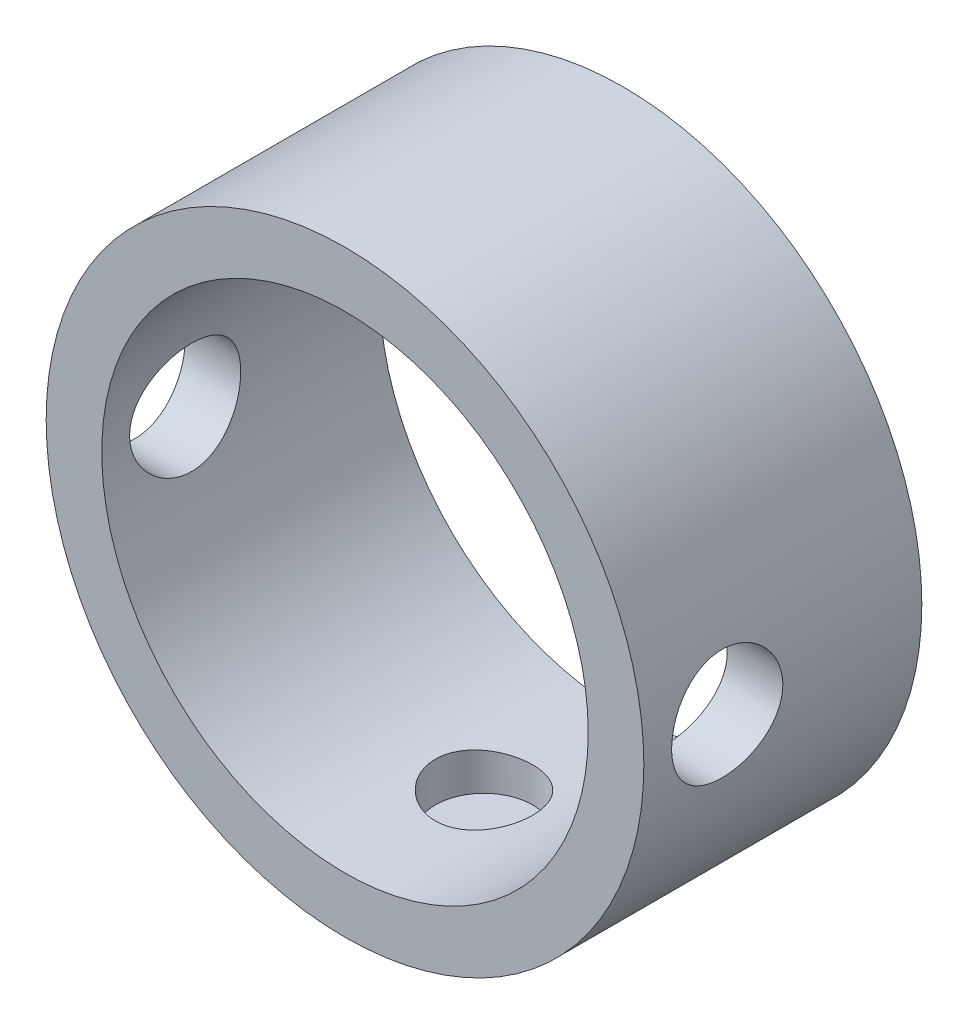
ISO-10303-21;
HEADER;
FILE_DESCRIPTION(('STEP AP214'),'2;1');
FILE_NAME('part.step','',(''),(''),'','','');
FILE_SCHEMA(('AUTOMOTIVE_DESIGN { 1 0 10303 214 1 1 1 1 }'));
ENDSEC;
DATA;
#1=APPLICATION_CONTEXT('core data for automotive mechanical design processes');
#2=APPLICATION_PROTOCOL_DEFINITION('international standard','automotive_design',2000,#1);
#3=PRODUCT_CONTEXT('',#1,'mechanical');
#4=PRODUCT('Part','Part','',(#3));
#5=PRODUCT_RELATED_PRODUCT_CATEGORY('part','',(#4));
#6=PRODUCT_DEFINITION_FORMATION('','',#4);
#7=PRODUCT_DEFINITION_CONTEXT('part definition',#1,'design');
#8=PRODUCT_DEFINITION('design','',#6,#7);
#9=PRODUCT_DEFINITION_SHAPE('','',#8);
#10=(LENGTH_UNIT() NAMED_UNIT(*) SI_UNIT(.MILLI.,.METRE.));
#11=(NAMED_UNIT(*) PLANE_ANGLE_UNIT() SI_UNIT($,.RADIAN.));
#12=(NAMED_UNIT(*) SI_UNIT($,.STERADIAN.) SOLID_ANGLE_UNIT());
#13=UNCERTAINTY_MEASURE_WITH_UNIT(LENGTH_MEASURE(1.E-05),#10,'distance_accuracy_value','');
#14=(GEOMETRIC_REPRESENTATION_CONTEXT(3) GLOBAL_UNCERTAINTY_ASSIGNED_CONTEXT((#13)) GLOBAL_UNIT_ASSIGNED_CONTEXT((#10,
#11,#12)) REPRESENTATION_CONTEXT('',''));
#15=CARTESIAN_POINT('',(0.,0.,0.));
#16=DIRECTION('',(0.,0.,1.));
#17=DIRECTION('',(1.,0.,0.));
#18=AXIS2_PLACEMENT_3D('',#15,#16,#17);
#19=CARTESIAN_POINT('',(0.,0.,10.));
#20=DIRECTION('',(0.,0.,1.));
#21=DIRECTION('',(1.,0.,0.));
#22=AXIS2_PLACEMENT_3D('',#19,#20,#21);
#23=PLANE('',#22);
#24=CARTESIAN_POINT('',(0.,0.,10.));
#25=DIRECTION('',(0.,0.,1.));
#26=DIRECTION('',(1.,0.,0.));
#27=AXIS2_PLACEMENT_3D('',#24,#25,#26);
#28=CIRCLE('',#27,10.75);
#29=CARTESIAN_POINT('',(10.75,0.,10.));
#30=VERTEX_POINT('',#29);
#31=EDGE_CURVE('E10',#30,#30,#28,.T.);
#32=ORIENTED_EDGE('',*,*,#31,.T.);
#33=EDGE_LOOP('',(#32));
#34=FACE_BOUND('',#33,.T.);
#35=CARTESIAN_POINT('',(0.,0.,10.));
#36=DIRECTION('',(0.,0.,1.));
#37=DIRECTION('',(1.,0.,0.));
#38=AXIS2_PLACEMENT_3D('',#35,#36,#37);
#39=CIRCLE('',#38,8.75);
#40=CARTESIAN_POINT('',(8.75,0.,10.));
#41=VERTEX_POINT('',#40);
#42=EDGE_CURVE('E49',#41,#41,#39,.T.);
#43=ORIENTED_EDGE('',*,*,#42,.F.);
#44=EDGE_LOOP('',(#43));
#45=FACE_BOUND('',#44,.T.);
#46=ADVANCED_FACE('F31',(#34,#45),#23,.T.);
#47=CARTESIAN_POINT('',(0.,0.,0.));
#48=DIRECTION('',(0.,0.,1.));
#49=DIRECTION('',(1.,0.,0.));
#50=AXIS2_PLACEMENT_3D('',#47,#48,#49);
#51=PLANE('',#50);
#52=CARTESIAN_POINT('',(0.,0.,0.));
#53=DIRECTION('',(0.,0.,1.));
#54=DIRECTION('',(1.,0.,0.));
#55=AXIS2_PLACEMENT_3D('',#52,#53,#54);
#56=CIRCLE('',#55,10.75);
#57=CARTESIAN_POINT('',(10.75,0.,0.));
#58=VERTEX_POINT('',#57);
#59=EDGE_CURVE('E44',#58,#58,#56,.T.);
#60=ORIENTED_EDGE('',*,*,#59,.F.);
#61=EDGE_LOOP('',(#60));
#62=FACE_BOUND('',#61,.T.);
#63=CARTESIAN_POINT('',(0.,0.,0.));
#64=DIRECTION('',(0.,0.,1.));
#65=DIRECTION('',(1.,0.,0.));
#66=AXIS2_PLACEMENT_3D('',#63,#64,#65);
#67=CIRCLE('',#66,8.75);
#68=CARTESIAN_POINT('',(8.75,0.,0.));
#69=VERTEX_POINT('',#68);
#70=EDGE_CURVE('E52',#69,#69,#67,.T.);
#71=ORIENTED_EDGE('',*,*,#70,.T.);
#72=EDGE_LOOP('',(#71));
#73=FACE_BOUND('',#72,.T.);
#74=ADVANCED_FACE('F101',(#62,#73),#51,.F.);
#75=CARTESIAN_POINT('',(0.,0.,10.));
#76=DIRECTION('',(0.,0.,-1.));
#77=DIRECTION('',(-1.,0.,0.));
#78=AXIS2_PLACEMENT_3D('',#75,#76,#77);
#79=CYLINDRICAL_SURFACE('',#78,10.75);
#80=CARTESIAN_POINT('',(-10.75,0.,9.));
#81=CARTESIAN_POINT('',(-10.7499979898458,-0.11131159379338,8.99999572987923));
#82=CARTESIAN_POINT('',(-10.7482532629214,-0.222678927988622,8.99067589570434));
#83=CARTESIAN_POINT('',(-10.7414613570524,-0.44227641097823,8.95366618191143));
#84=CARTESIAN_POINT('',(-10.7364113726521,-0.55050381307307,8.92596069653518));
#85=CARTESIAN_POINT('',(-10.7235739677097,-0.760613722877673,8.85305648014376));
#86=CARTESIAN_POINT('',(-10.7157890029718,-0.862501826502631,8.80787343897761));
#87=CARTESIAN_POINT('',(-10.6983321752382,-1.05724142795962,8.70134097973054));
#88=CARTESIAN_POINT('',(-10.6886604695776,-1.15009367832323,8.63999290949974));
#89=CARTESIAN_POINT('',(-10.6683704245625,-1.32523104603137,8.5021033437944));
#90=CARTESIAN_POINT('',(-10.6577431617574,-1.40739412690166,8.4254081434464));
#91=CARTESIAN_POINT('',(-10.6368061412874,-1.55776522630777,8.25933206935554));
#92=CARTESIAN_POINT('',(-10.626496406262,-1.62597225173912,8.16995029360961));
#93=CARTESIAN_POINT('',(-10.6072750364208,-1.74700132637669,7.98017760282761));
#94=CARTESIAN_POINT('',(-10.5983749089917,-1.79969948726446,7.87970640896275));
#95=CARTESIAN_POINT('',(-10.5831060557579,-1.88742190435403,7.67114363019245));
#96=CARTESIAN_POINT('',(-10.5767371151844,-1.92244766011071,7.56305269273174));
#97=CARTESIAN_POINT('',(-10.5673414942507,-1.973439875545,7.34362364439491));
#98=CARTESIAN_POINT('',(-10.5642775486884,-1.98961900866356,7.23233658297204));
#99=CARTESIAN_POINT('',(-10.5617264498057,-2.00311878575036,7.00858852041986));
#100=CARTESIAN_POINT('',(-10.5622389807437,-2.00044109445366,6.89612762379538));
#101=CARTESIAN_POINT('',(-10.5667489902013,-1.97647574032907,6.6747633700392));
#102=CARTESIAN_POINT('',(-10.5707012207446,-1.95542969630261,6.56583279686444));
#103=CARTESIAN_POINT('',(-10.5815742581251,-1.89570547233203,6.35307612785986));
#104=CARTESIAN_POINT('',(-10.5884951893386,-1.85702655363861,6.24925024609882));
#105=CARTESIAN_POINT('',(-10.6045732299577,-1.76289760519039,6.04894203213756));
#106=CARTESIAN_POINT('',(-10.6137433132819,-1.70734981035866,5.95250672612123));
#107=CARTESIAN_POINT('',(-10.6332778111083,-1.58112906966637,5.7702346903743));
#108=CARTESIAN_POINT('',(-10.6436423449628,-1.51045461170914,5.68439902156196));
#109=CARTESIAN_POINT('',(-10.6645952021616,-1.35468302139281,5.52436661849693));
#110=CARTESIAN_POINT('',(-10.6751845030451,-1.26937917698147,5.45037107360264));
#111=CARTESIAN_POINT('',(-10.6952459378521,-1.08746251784783,5.31771042100191));
#112=CARTESIAN_POINT('',(-10.7047180608997,-0.990849593049999,5.25904546253179));
#113=CARTESIAN_POINT('',(-10.7214965653293,-0.788848913738091,5.15868245967962));
#114=CARTESIAN_POINT('',(-10.7288003023682,-0.683450644392863,5.11700510875821));
#115=CARTESIAN_POINT('',(-10.7403986151714,-0.466983118908588,5.05200257111017));
#116=CARTESIAN_POINT('',(-10.7446935055784,-0.355914457040342,5.02867546542097));
#117=CARTESIAN_POINT('',(-10.749747054897,-0.13299011359431,5.00131508847892));
#118=CARTESIAN_POINT('',(-10.7505562406137,-0.0211693776720211,4.99700611832965));
#119=CARTESIAN_POINT('',(-10.7486866910348,0.201594891573391,5.00706512429286));
#120=CARTESIAN_POINT('',(-10.746008124353,0.312538467041593,5.02143219752003));
#121=CARTESIAN_POINT('',(-10.7374954871991,0.529526335547115,5.06820623777382));
#122=CARTESIAN_POINT('',(-10.7316857895141,0.635601691889519,5.10047392223406));
#123=CARTESIAN_POINT('',(-10.7175596292842,0.840836917634937,5.18198266408515));
#124=CARTESIAN_POINT('',(-10.7092429986024,0.93999632264453,5.2312248599665));
#125=CARTESIAN_POINT('',(-10.690899466265,1.12976302751242,5.34589657796905));
#126=CARTESIAN_POINT('',(-10.6808550983115,1.22026664017755,5.41149483797731));
#127=CARTESIAN_POINT('',(-10.6602158463005,1.38908020214383,5.55678798245869));
#128=CARTESIAN_POINT('',(-10.6496209117495,1.46738903039658,5.63648416149583));
#129=CARTESIAN_POINT('',(-10.6289073271526,1.61063585835205,5.80895817564184));
#130=CARTESIAN_POINT('',(-10.6187967061924,1.67538584359746,5.90189328874258));
#131=CARTESIAN_POINT('',(-10.6003572432835,1.78835572865782,6.09748322825249));
#132=CARTESIAN_POINT('',(-10.5920283357576,1.83657623689074,6.20013769673351));
#133=CARTESIAN_POINT('',(-10.5781581458697,1.91485072686294,6.41177151124483));
#134=CARTESIAN_POINT('',(-10.5726035790055,1.94499142330357,6.52071787390127));
#135=CARTESIAN_POINT('',(-10.5648804078248,1.98651855905319,6.74224124574429));
#136=CARTESIAN_POINT('',(-10.5627114280671,1.99790707787205,6.85481785094575));
#137=CARTESIAN_POINT('',(-10.5620238464973,2.0015378387343,7.07852322734323));
#138=CARTESIAN_POINT('',(-10.5634487096283,1.99407660485924,7.18964712056155));
#139=CARTESIAN_POINT('',(-10.5696630140558,1.96086826235294,7.40902732963684));
#140=CARTESIAN_POINT('',(-10.5744524359854,1.93512125897719,7.51728366199618));
#141=CARTESIAN_POINT('',(-10.5868325708344,1.86619652593107,7.72769952322193));
#142=CARTESIAN_POINT('',(-10.5944181984275,1.82305042586657,7.82986973122518));
#143=CARTESIAN_POINT('',(-10.6115397210939,1.72058453403723,8.02556856504766));
#144=CARTESIAN_POINT('',(-10.6210757509919,1.66126362406717,8.11909659281254));
#145=CARTESIAN_POINT('',(-10.6411993787578,1.52709910875286,8.29634244119845));
#146=CARTESIAN_POINT('',(-10.6518004083814,1.45203952456124,8.37989528142713));
#147=CARTESIAN_POINT('',(-10.6727585996435,1.28897910123111,8.53331890454813));
#148=CARTESIAN_POINT('',(-10.6831157046926,1.20097529273818,8.60318653951033));
#149=CARTESIAN_POINT('',(-10.7025264342028,1.01359257586739,8.72783285057219));
#150=CARTESIAN_POINT('',(-10.7115677213292,0.914119954343318,8.78247262327906));
#151=CARTESIAN_POINT('',(-10.7272076880381,0.707271124587948,8.87417762043734));
#152=CARTESIAN_POINT('',(-10.7338086708492,0.599902484214423,8.91125942592901));
#153=CARTESIAN_POINT('',(-10.7424715014638,0.410175384596366,8.95922830111321));
#154=CARTESIAN_POINT('',(-10.745278807836,0.328929119163652,8.97449168030223));
#155=CARTESIAN_POINT('',(-10.7490437798718,0.165132107553959,8.99487898823888));
#156=CARTESIAN_POINT('',(-10.7500014913211,0.0825813937188459,9.0000031679766));
#157=CARTESIAN_POINT('',(-10.75,0.,9.));
#158=B_SPLINE_CURVE_WITH_KNOTS('',3,(#80,#81,#82,#83,#84,#85,#86,#87,#88,#89,#90,#91,#92,#93,
#94,#95,#96,#97,#98,#99,#100,#101,#102,#103,#104,#105,#106,#107,#108,#109,#110,#111,#112,#113,
#114,#115,#116,#117,#118,#119,#120,#121,#122,#123,#124,#125,#126,#127,#128,#129,#130,#131,#132,
#133,#134,#135,#136,#137,#138,#139,#140,#141,#142,#143,#144,#145,#146,#147,#148,#149,#150,#151,
#152,#153,#154,#155,#156,#157),.UNSPECIFIED.,.T.,.F.,(4,2,2,2,2,2,2,2,2,2,2,2,2,2,2,2,2,2,2,2,2,
2,2,2,2,2,2,2,2,2,2,2,2,2,2,2,2,2,4),(0.,0.333632786805725,0.66754912427414,1.0011663934096,
1.33475585412829,1.67187050268572,2.00900913178154,2.3487720265472,2.68850608659447,
3.02436811950802,3.36020050192062,3.69168078753446,4.02317496216753,4.35662824282037,
4.6901148718247,5.02877436453897,5.36743715382766,5.70651126118907,6.04554990542494,
6.37965713991974,6.71374822274426,7.04527552096235,7.37682505923946,7.71194784376343,
8.04710141746387,8.38663285340674,8.72615179051432,9.06402902298356,9.40186878426492,
9.73442721190291,10.0669837253029,10.3989383941257,10.7309160176291,11.0677885056382,
11.4047383917492,11.7446680944371,12.0842761377135,12.3318023983814,12.5793225316019),.UNSPECIFIED.);
#159=CARTESIAN_POINT('',(-10.75,0.,9.));
#160=VERTEX_POINT('',#159);
#161=EDGE_CURVE('E89',#160,#160,#158,.T.);
#162=ORIENTED_EDGE('',*,*,#161,.T.);
#163=EDGE_LOOP('',(#162));
#164=FACE_BOUND('',#163,.T.);
#165=CARTESIAN_POINT('',(10.75,0.,5.));
#166=CARTESIAN_POINT('',(10.7499979898458,-0.11131159379338,5.00000427012077));
#167=CARTESIAN_POINT('',(10.7482532629214,-0.222678927988622,5.00932410429566));
#168=CARTESIAN_POINT('',(10.7414613570524,-0.44227641097823,5.04633381808857));
#169=CARTESIAN_POINT('',(10.7364113726521,-0.55050381307307,5.07403930346482));
#170=CARTESIAN_POINT('',(10.7235739677097,-0.760613722877673,5.14694351985624));
#171=CARTESIAN_POINT('',(10.7157890029718,-0.862501826502631,5.19212656102239));
#172=CARTESIAN_POINT('',(10.6983321752382,-1.05724142795962,5.29865902026946));
#173=CARTESIAN_POINT('',(10.6886604695776,-1.15009367832323,5.36000709050025));
#174=CARTESIAN_POINT('',(10.6683704245625,-1.32523104603137,5.4978966562056));
#175=CARTESIAN_POINT('',(10.6577431617574,-1.40739412690166,5.5745918565536));
#176=CARTESIAN_POINT('',(10.6368061412874,-1.55776522630777,5.74066793064446));
#177=CARTESIAN_POINT('',(10.626496406262,-1.62597225173912,5.83004970639039));
#178=CARTESIAN_POINT('',(10.6072750364208,-1.74700132637669,6.01982239717239));
#179=CARTESIAN_POINT('',(10.5983749089917,-1.79969948726446,6.12029359103725));
#180=CARTESIAN_POINT('',(10.5831060557579,-1.88742190435403,6.32885636980755));
#181=CARTESIAN_POINT('',(10.5767371151844,-1.92244766011071,6.43694730726826));
#182=CARTESIAN_POINT('',(10.5673414942507,-1.973439875545,6.65637635560509));
#183=CARTESIAN_POINT('',(10.5642775486884,-1.98961900866356,6.76766341702796));
#184=CARTESIAN_POINT('',(10.5617264498057,-2.00311878575036,6.99141147958014));
#185=CARTESIAN_POINT('',(10.5622389807437,-2.00044109445366,7.10387237620462));
#186=CARTESIAN_POINT('',(10.5667489902013,-1.97647574032907,7.3252366299608));
#187=CARTESIAN_POINT('',(10.5707012207446,-1.95542969630261,7.43416720313556));
#188=CARTESIAN_POINT('',(10.5815742581251,-1.89570547233203,7.64692387214014));
#189=CARTESIAN_POINT('',(10.5884951893386,-1.85702655363861,7.75074975390118));
#190=CARTESIAN_POINT('',(10.6045732299577,-1.76289760519039,7.95105796786244));
#191=CARTESIAN_POINT('',(10.6137433132819,-1.70734981035866,8.04749327387877));
#192=CARTESIAN_POINT('',(10.6332778111083,-1.58112906966637,8.2297653096257));
#193=CARTESIAN_POINT('',(10.6436423449628,-1.51045461170914,8.31560097843804));
#194=CARTESIAN_POINT('',(10.6645952021616,-1.35468302139281,8.47563338150307));
#195=CARTESIAN_POINT('',(10.6751845030451,-1.26937917698147,8.54962892639736));
#196=CARTESIAN_POINT('',(10.6952459378521,-1.08746251784783,8.68228957899809));
#197=CARTESIAN_POINT('',(10.7047180608997,-0.990849593049999,8.74095453746821));
#198=CARTESIAN_POINT('',(10.7214965653293,-0.788848913738091,8.84131754032038));
#199=CARTESIAN_POINT('',(10.7288003023682,-0.683450644392863,8.88299489124179));
#200=CARTESIAN_POINT('',(10.7403986151714,-0.466983118908589,8.94799742888983));
#201=CARTESIAN_POINT('',(10.7446935055784,-0.355914457040342,8.97132453457903));
#202=CARTESIAN_POINT('',(10.749747054897,-0.13299011359431,8.99868491152108));
#203=CARTESIAN_POINT('',(10.7505562406137,-0.021169377672021,9.00299388167035));
#204=CARTESIAN_POINT('',(10.7486866910348,0.201594891573391,8.99293487570714));
#205=CARTESIAN_POINT('',(10.746008124353,0.312538467041593,8.97856780247997));
#206=CARTESIAN_POINT('',(10.7374954871991,0.529526335547115,8.93179376222618));
#207=CARTESIAN_POINT('',(10.7316857895141,0.63560169188952,8.89952607776595));
#208=CARTESIAN_POINT('',(10.7175596292842,0.840836917634938,8.81801733591485));
#209=CARTESIAN_POINT('',(10.7092429986024,0.939996322644531,8.7687751400335));
#210=CARTESIAN_POINT('',(10.690899466265,1.12976302751242,8.65410342203095));
#211=CARTESIAN_POINT('',(10.6808550983115,1.22026664017754,8.58850516202269));
#212=CARTESIAN_POINT('',(10.6602158463005,1.38908020214383,8.44321201754131));
#213=CARTESIAN_POINT('',(10.6496209117495,1.46738903039658,8.36351583850417));
#214=CARTESIAN_POINT('',(10.6289073271526,1.61063585835205,8.19104182435816));
#215=CARTESIAN_POINT('',(10.6187967061924,1.67538584359746,8.09810671125742));
#216=CARTESIAN_POINT('',(10.6003572432835,1.78835572865782,7.90251677174751));
#217=CARTESIAN_POINT('',(10.5920283357576,1.83657623689074,7.79986230326649));
#218=CARTESIAN_POINT('',(10.5781581458697,1.91485072686294,7.58822848875517));
#219=CARTESIAN_POINT('',(10.5726035790055,1.94499142330357,7.47928212609873));
#220=CARTESIAN_POINT('',(10.5648804078248,1.98651855905319,7.25775875425571));
#221=CARTESIAN_POINT('',(10.5627114280671,1.99790707787205,7.14518214905425));
#222=CARTESIAN_POINT('',(10.5620238464973,2.0015378387343,6.92147677265677));
#223=CARTESIAN_POINT('',(10.5634487096283,1.99407660485924,6.81035287943845));
#224=CARTESIAN_POINT('',(10.5696630140558,1.96086826235294,6.59097267036316));
#225=CARTESIAN_POINT('',(10.5744524359854,1.93512125897719,6.48271633800382));
#226=CARTESIAN_POINT('',(10.5868325708344,1.86619652593107,6.27230047677807));
#227=CARTESIAN_POINT('',(10.5944181984275,1.82305042586657,6.17013026877482));
#228=CARTESIAN_POINT('',(10.6115397210939,1.72058453403723,5.97443143495234));
#229=CARTESIAN_POINT('',(10.6210757509919,1.66126362406717,5.88090340718746));
#230=CARTESIAN_POINT('',(10.6411993787578,1.52709910875286,5.70365755880155));
#231=CARTESIAN_POINT('',(10.6518004083814,1.45203952456124,5.62010471857287));
#232=CARTESIAN_POINT('',(10.6727585996435,1.28897910123111,5.46668109545187));
#233=CARTESIAN_POINT('',(10.6831157046926,1.20097529273818,5.39681346048967));
#234=CARTESIAN_POINT('',(10.7025264342028,1.01359257586739,5.27216714942781));
#235=CARTESIAN_POINT('',(10.7115677213292,0.914119954343319,5.21752737672094));
#236=CARTESIAN_POINT('',(10.7272076880381,0.707271124587948,5.12582237956266));
#237=CARTESIAN_POINT('',(10.7338086708492,0.599902484214423,5.08874057407099));
#238=CARTESIAN_POINT('',(10.7424715014638,0.410175384596365,5.04077169888679));
#239=CARTESIAN_POINT('',(10.745278807836,0.328929119163651,5.02550831969777));
#240=CARTESIAN_POINT('',(10.7490437798718,0.165132107553958,5.00512101176112));
#241=CARTESIAN_POINT('',(10.7500014913211,0.0825813937188454,4.9999968320234));
#242=CARTESIAN_POINT('',(10.75,0.,5.));
#243=B_SPLINE_CURVE_WITH_KNOTS('',3,(#165,#166,#167,#168,#169,#170,#171,#172,#173,#174,#175,
#176,#177,#178,#179,#180,#181,#182,#183,#184,#185,#186,#187,#188,#189,#190,#191,#192,#193,#194,
#195,#196,#197,#198,#199,#200,#201,#202,#203,#204,#205,#206,#207,#208,#209,#210,#211,#212,#213,
#214,#215,#216,#217,#218,#219,#220,#221,#222,#223,#224,#225,#226,#227,#228,#229,#230,#231,#232,
#233,#234,#235,#236,#237,#238,#239,#240,#241,#242),.UNSPECIFIED.,.T.,.F.,(4,2,2,2,2,2,2,2,2,2,2,
2,2,2,2,2,2,2,2,2,2,2,2,2,2,2,2,2,2,2,2,2,2,2,2,2,2,2,4),(0.,0.333632786805725,0.66754912427414,
1.0011663934096,1.33475585412829,1.67187050268572,2.00900913178154,2.3487720265472,
2.68850608659447,3.02436811950802,3.36020050192062,3.69168078753446,4.02317496216753,
4.35662824282037,4.6901148718247,5.02877436453897,5.36743715382766,5.70651126118907,
6.04554990542494,6.37965713991974,6.71374822274426,7.04527552096235,7.37682505923946,
7.71194784376343,8.04710141746387,8.38663285340674,8.72615179051432,9.06402902298357,
9.40186878426492,9.73442721190291,10.0669837253029,10.3989383941257,10.7309160176291,
11.0677885056382,11.4047383917491,11.7446680944371,12.0842761377135,12.3318023983814,
12.5793225316019),.UNSPECIFIED.);
#244=CARTESIAN_POINT('',(10.75,0.,5.));
#245=VERTEX_POINT('',#244);
#246=EDGE_CURVE('E85',#245,#245,#243,.T.);
#247=ORIENTED_EDGE('',*,*,#246,.T.);
#248=EDGE_LOOP('',(#247));
#249=FACE_BOUND('',#248,.T.);
#250=ORIENTED_EDGE('',*,*,#31,.F.);
#251=EDGE_LOOP('',(#250));
#252=FACE_BOUND('',#251,.T.);
#253=ORIENTED_EDGE('',*,*,#59,.T.);
#254=EDGE_LOOP('',(#253));
#255=FACE_BOUND('',#254,.T.);
#256=ADVANCED_FACE('F33',(#164,#249,#252,#255),#79,.T.);
#257=CARTESIAN_POINT('',(0.,0.,10.));
#258=DIRECTION('',(0.,0.,-1.));
#259=DIRECTION('',(-1.,0.,0.));
#260=AXIS2_PLACEMENT_3D('',#257,#258,#259);
#261=CYLINDRICAL_SURFACE('',#260,8.75);
#262=CARTESIAN_POINT('',(-8.75,0.,9.));
#263=CARTESIAN_POINT('',(-8.74999798403401,-0.110797467641392,8.99999640079627));
#264=CARTESIAN_POINT('',(-8.74787426792563,-0.221637378479564,8.99076188264202));
#265=CARTESIAN_POINT('',(-8.73960765256352,-0.440160260645337,8.95411123361261));
#266=CARTESIAN_POINT('',(-8.73346206074067,-0.547841066516225,8.92668292217251));
#267=CARTESIAN_POINT('',(-8.71783483861599,-0.756856803303784,8.85455543125254));
#268=CARTESIAN_POINT('',(-8.70835685325835,-0.858198525771152,8.80987511664681));
#269=CARTESIAN_POINT('',(-8.68708367861657,-1.05194510817363,8.70457381564098));
#270=CARTESIAN_POINT('',(-8.6752885067451,-1.14435003525719,8.64395294902623));
#271=CARTESIAN_POINT('',(-8.65043976491944,-1.31921284380598,8.50737389507973));
#272=CARTESIAN_POINT('',(-8.63736940910119,-1.40149269853396,8.43119081567529));
#273=CARTESIAN_POINT('',(-8.61155960188236,-1.55222495575719,8.26613230531634));
#274=CARTESIAN_POINT('',(-8.59882018230991,-1.62067603251486,8.17725565884752));
#275=CARTESIAN_POINT('',(-8.5749480986638,-1.7426086602488,7.98799671893209));
#276=CARTESIAN_POINT('',(-8.56383688728399,-1.7958977927077,7.88748750837005));
#277=CARTESIAN_POINT('',(-8.54472144233678,-1.88475865669925,7.67864406419753));
#278=CARTESIAN_POINT('',(-8.53671680029431,-1.92033271771674,7.57031086156757));
#279=CARTESIAN_POINT('',(-8.52489227385479,-1.97215951306484,7.35083404907676));
#280=CARTESIAN_POINT('',(-8.52100387809606,-1.98872896544198,7.23976900047027));
#281=CARTESIAN_POINT('',(-8.51764655638893,-2.00306153817964,7.01637271053663));
#282=CARTESIAN_POINT('',(-8.51817703514422,-2.00082719172597,6.90404164179968));
#283=CARTESIAN_POINT('',(-8.52353562985453,-1.97786980705357,6.68367804056806));
#284=CARTESIAN_POINT('',(-8.52827756816924,-1.95751749105999,6.57560447034978));
#285=CARTESIAN_POINT('',(-8.54138821006848,-1.8994904479953,6.36444753170819));
#286=CARTESIAN_POINT('',(-8.54975713382707,-1.86181466930495,6.261364466653));
#287=CARTESIAN_POINT('',(-8.5692619328989,-1.76987724439003,6.06208706765963));
#288=CARTESIAN_POINT('',(-8.58042102861084,-1.71547548139628,5.96595974478273));
#289=CARTESIAN_POINT('',(-8.60423493168342,-1.59172870462855,5.78406237242601));
#290=CARTESIAN_POINT('',(-8.61688996045725,-1.52238147752176,5.69829385996216));
#291=CARTESIAN_POINT('',(-8.64263752527252,-1.36876252532966,5.53741725607761));
#292=CARTESIAN_POINT('',(-8.65573332503362,-1.28417625671286,5.46260971941315));
#293=CARTESIAN_POINT('',(-8.68061476724555,-1.1035077310898,5.32819019732693));
#294=CARTESIAN_POINT('',(-8.69240038152673,-1.00742522700097,5.26857853858847));
#295=CARTESIAN_POINT('',(-8.71337750142071,-0.806106214040118,5.16615796797739));
#296=CARTESIAN_POINT('',(-8.72256247378175,-0.700847504640298,5.12339127001632));
#297=CARTESIAN_POINT('',(-8.73725525366348,-0.484380292611527,5.0562376655254));
#298=CARTESIAN_POINT('',(-8.74276364631752,-0.37317273979472,5.03184783420908));
#299=CARTESIAN_POINT('',(-8.74939833356695,-0.150540119696463,5.00258401054654));
#300=CARTESIAN_POINT('',(-8.7506167116947,-0.0391716359777115,4.99729985446289));
#301=CARTESIAN_POINT('',(-8.74879340725784,0.182857018013344,5.00528166466136));
#302=CARTESIAN_POINT('',(-8.74575204174862,0.293517240386154,5.01854625034885));
#303=CARTESIAN_POINT('',(-8.73580937302033,0.509609141351124,5.06290941008401));
#304=CARTESIAN_POINT('',(-8.72895522155222,0.61508788434986,5.09379024518131));
#305=CARTESIAN_POINT('',(-8.71215539529353,0.819366874320132,5.17226552038315));
#306=CARTESIAN_POINT('',(-8.70220944106296,0.918166516645306,5.2198614712658));
#307=CARTESIAN_POINT('',(-8.68010385006686,1.1079596090638,5.33125236753804));
#308=CARTESIAN_POINT('',(-8.66791255784382,1.1988098472004,5.3952848989444));
#309=CARTESIAN_POINT('',(-8.64272842827592,1.3686224607752,5.53742128648349));
#310=CARTESIAN_POINT('',(-8.62973547673384,1.4475831369953,5.61552715043462));
#311=CARTESIAN_POINT('',(-8.6040902131529,1.59301791769619,5.78548263167875));
#312=CARTESIAN_POINT('',(-8.59145012752951,1.65920678045592,5.87757853832288));
#313=CARTESIAN_POINT('',(-8.56824022421961,1.775182108422,6.07181838937212));
#314=CARTESIAN_POINT('',(-8.55767031480589,1.82496930043483,6.17396188827818));
#315=CARTESIAN_POINT('',(-8.53990401178754,1.90637791843995,6.38484124761117));
#316=CARTESIAN_POINT('',(-8.53268815290462,1.9381044077648,6.49353482670534));
#317=CARTESIAN_POINT('',(-8.52241600386035,1.98279118460991,6.71489852704255));
#318=CARTESIAN_POINT('',(-8.51935897721024,1.99575479487958,6.8275679405773));
#319=CARTESIAN_POINT('',(-8.51780002775368,2.0023964245858,7.05080151145508));
#320=CARTESIAN_POINT('',(-8.51919104574016,1.99652770403295,7.16135167231237));
#321=CARTESIAN_POINT('',(-8.5261276991631,1.96669181064342,7.37984245044717));
#322=CARTESIAN_POINT('',(-8.5316732759895,1.94272489312539,7.48778310451589));
#323=CARTESIAN_POINT('',(-8.54623968631577,1.87760087333832,7.69759076992579));
#324=CARTESIAN_POINT('',(-8.55524600646941,1.8365155009943,7.7994811212922));
#325=CARTESIAN_POINT('',(-8.57572358289991,1.73838043292354,7.99498789835382));
#326=CARTESIAN_POINT('',(-8.5871951226817,1.6813289008299,8.08860337067323));
#327=CARTESIAN_POINT('',(-8.61162602277799,1.55140256712376,8.26712433310921));
#328=CARTESIAN_POINT('',(-8.62461256398907,1.47820725203166,8.35179287976362));
#329=CARTESIAN_POINT('',(-8.65043404659231,1.31871330392506,8.50779369951286));
#330=CARTESIAN_POINT('',(-8.66326895202616,1.2324116275705,8.57912286655374));
#331=CARTESIAN_POINT('',(-8.68756156917111,1.04765015456509,8.7074134392105));
#332=CARTESIAN_POINT('',(-8.69899669105796,0.949032641040302,8.76415224848661));
#333=CARTESIAN_POINT('',(-8.7189716042072,0.743415447709609,8.86015727120685));
#334=CARTESIAN_POINT('',(-8.72751371799773,0.636422577070974,8.89943750847249));
#335=CARTESIAN_POINT('',(-8.73929351226494,0.441171611569102,8.95275694443017));
#336=CARTESIAN_POINT('',(-8.74328278089225,0.353935004208256,8.97043798341672));
#337=CARTESIAN_POINT('',(-8.74863676482031,0.177807984983747,8.99406064737427));
#338=CARTESIAN_POINT('',(-8.7500016178617,0.0889176601615591,9.00000288844845));
#339=CARTESIAN_POINT('',(-8.75,0.,9.));
#340=B_SPLINE_CURVE_WITH_KNOTS('',3,(#262,#263,#264,#265,#266,#267,#268,#269,#270,#271,#272,
#273,#274,#275,#276,#277,#278,#279,#280,#281,#282,#283,#284,#285,#286,#287,#288,#289,#290,#291,
#292,#293,#294,#295,#296,#297,#298,#299,#300,#301,#302,#303,#304,#305,#306,#307,#308,#309,#310,
#311,#312,#313,#314,#315,#316,#317,#318,#319,#320,#321,#322,#323,#324,#325,#326,#327,#328,#329,
#330,#331,#332,#333,#334,#335,#336,#337,#338,#339),.UNSPECIFIED.,.T.,.F.,(4,2,2,2,2,2,2,2,2,2,2,
2,2,2,2,2,2,2,2,2,2,2,2,2,2,2,2,2,2,2,2,2,2,2,2,2,2,2,4),(0.,0.332066818475209,
0.664356177092314,0.99628320531963,1.32820773935135,1.6653197412289,2.00246404604652,
2.3437134474544,2.68491796361531,3.02034957114242,3.35573599115222,3.68441369615285,
4.01311135613861,4.3446412775613,4.67622033033866,5.01565166931443,5.35509030482184,
5.69537425118619,6.0356040279111,6.36848482422126,6.70134084532106,7.03016920546846,
7.35902729407257,7.69293661513047,8.02689361223734,8.36761344785936,8.70831818314735,
9.04702015616859,9.38566214055255,9.71621531054079,10.0467638173678,10.3759409682167,
10.7051559953392,11.0416141114234,11.3781504739792,11.7195515993372,12.0606779920518,
12.3271836708532,12.5936753619059),.UNSPECIFIED.);
#341=CARTESIAN_POINT('',(-8.75,0.,9.));
#342=VERTEX_POINT('',#341);
#343=EDGE_CURVE('E36',#342,#342,#340,.T.);
#344=ORIENTED_EDGE('',*,*,#343,.F.);
#345=EDGE_LOOP('',(#344));
#346=FACE_BOUND('',#345,.T.);
#347=CARTESIAN_POINT('',(8.75,0.,5.));
#348=CARTESIAN_POINT('',(8.74999798403401,-0.110797467641392,5.00000359920373));
#349=CARTESIAN_POINT('',(8.74787426792563,-0.221637378479564,5.00923811735798));
#350=CARTESIAN_POINT('',(8.73960765256352,-0.440160260645337,5.04588876638739));
#351=CARTESIAN_POINT('',(8.73346206074067,-0.547841066516225,5.07331707782749));
#352=CARTESIAN_POINT('',(8.71783483861599,-0.756856803303785,5.14544456874746));
#353=CARTESIAN_POINT('',(8.70835685325835,-0.858198525771153,5.19012488335319));
#354=CARTESIAN_POINT('',(8.68708367861657,-1.05194510817363,5.29542618435902));
#355=CARTESIAN_POINT('',(8.6752885067451,-1.14435003525719,5.35604705097377));
#356=CARTESIAN_POINT('',(8.65043976491944,-1.31921284380598,5.49262610492027));
#357=CARTESIAN_POINT('',(8.63736940910119,-1.40149269853396,5.56880918432471));
#358=CARTESIAN_POINT('',(8.61155960188236,-1.55222495575719,5.73386769468366));
#359=CARTESIAN_POINT('',(8.59882018230991,-1.62067603251486,5.82274434115248));
#360=CARTESIAN_POINT('',(8.5749480986638,-1.7426086602488,6.01200328106791));
#361=CARTESIAN_POINT('',(8.56383688728399,-1.7958977927077,6.11251249162995));
#362=CARTESIAN_POINT('',(8.54472144233678,-1.88475865669925,6.32135593580247));
#363=CARTESIAN_POINT('',(8.53671680029431,-1.92033271771674,6.42968913843243));
#364=CARTESIAN_POINT('',(8.52489227385479,-1.97215951306484,6.64916595092324));
#365=CARTESIAN_POINT('',(8.52100387809606,-1.98872896544198,6.76023099952973));
#366=CARTESIAN_POINT('',(8.51764655638893,-2.00306153817964,6.98362728946337));
#367=CARTESIAN_POINT('',(8.51817703514422,-2.00082719172597,7.09595835820032));
#368=CARTESIAN_POINT('',(8.52353562985453,-1.97786980705357,7.31632195943194));
#369=CARTESIAN_POINT('',(8.52827756816924,-1.95751749105999,7.42439552965022));
#370=CARTESIAN_POINT('',(8.54138821006848,-1.8994904479953,7.63555246829181));
#371=CARTESIAN_POINT('',(8.54975713382707,-1.86181466930495,7.738635533347));
#372=CARTESIAN_POINT('',(8.5692619328989,-1.76987724439003,7.93791293234036));
#373=CARTESIAN_POINT('',(8.58042102861084,-1.71547548139628,8.03404025521727));
#374=CARTESIAN_POINT('',(8.60423493168342,-1.59172870462855,8.21593762757399));
#375=CARTESIAN_POINT('',(8.61688996045725,-1.52238147752176,8.30170614003784));
#376=CARTESIAN_POINT('',(8.64263752527252,-1.36876252532966,8.46258274392239));
#377=CARTESIAN_POINT('',(8.65573332503362,-1.28417625671285,8.53739028058685));
#378=CARTESIAN_POINT('',(8.68061476724555,-1.1035077310898,8.67180980267307));
#379=CARTESIAN_POINT('',(8.69240038152673,-1.00742522700097,8.73142146141153));
#380=CARTESIAN_POINT('',(8.71337750142071,-0.806106214040119,8.83384203202261));
#381=CARTESIAN_POINT('',(8.72256247378175,-0.700847504640299,8.87660872998368));
#382=CARTESIAN_POINT('',(8.73725525366348,-0.484380292611528,8.9437623344746));
#383=CARTESIAN_POINT('',(8.74276364631752,-0.373172739794721,8.96815216579092));
#384=CARTESIAN_POINT('',(8.74939833356695,-0.150540119696464,8.99741598945346));
#385=CARTESIAN_POINT('',(8.7506167116947,-0.0391716359777124,9.00270014553711));
#386=CARTESIAN_POINT('',(8.74879340725784,0.182857018013343,8.99471833533864));
#387=CARTESIAN_POINT('',(8.74575204174862,0.293517240386154,8.98145374965115));
#388=CARTESIAN_POINT('',(8.73580937302033,0.509609141351123,8.93709058991599));
#389=CARTESIAN_POINT('',(8.72895522155222,0.615087884349859,8.90620975481869));
#390=CARTESIAN_POINT('',(8.71215539529353,0.819366874320131,8.82773447961685));
#391=CARTESIAN_POINT('',(8.70220944106296,0.918166516645305,8.7801385287342));
#392=CARTESIAN_POINT('',(8.68010385006686,1.1079596090638,8.66874763246196));
#393=CARTESIAN_POINT('',(8.66791255784382,1.1988098472004,8.6047151010556));
#394=CARTESIAN_POINT('',(8.64272842827592,1.3686224607752,8.46257871351652));
#395=CARTESIAN_POINT('',(8.62973547673384,1.4475831369953,8.38447284956539));
#396=CARTESIAN_POINT('',(8.6040902131529,1.59301791769618,8.21451736832126));
#397=CARTESIAN_POINT('',(8.59145012752951,1.65920678045592,8.12242146167712));
#398=CARTESIAN_POINT('',(8.56824022421961,1.775182108422,7.92818161062789));
#399=CARTESIAN_POINT('',(8.55767031480589,1.82496930043483,7.82603811172182));
#400=CARTESIAN_POINT('',(8.53990401178754,1.90637791843995,7.61515875238883));
#401=CARTESIAN_POINT('',(8.53268815290462,1.9381044077648,7.50646517329466));
#402=CARTESIAN_POINT('',(8.52241600386035,1.98279118460991,7.28510147295745));
#403=CARTESIAN_POINT('',(8.51935897721024,1.99575479487958,7.1724320594227));
#404=CARTESIAN_POINT('',(8.51780002775368,2.0023964245858,6.94919848854492));
#405=CARTESIAN_POINT('',(8.51919104574016,1.99652770403295,6.83864832768764));
#406=CARTESIAN_POINT('',(8.5261276991631,1.96669181064342,6.62015754955283));
#407=CARTESIAN_POINT('',(8.5316732759895,1.94272489312539,6.51221689548412));
#408=CARTESIAN_POINT('',(8.54623968631577,1.87760087333832,6.30240923007421));
#409=CARTESIAN_POINT('',(8.55524600646941,1.8365155009943,6.2005188787078));
#410=CARTESIAN_POINT('',(8.57572358289991,1.73838043292354,6.00501210164618));
#411=CARTESIAN_POINT('',(8.5871951226817,1.6813289008299,5.91139662932677));
#412=CARTESIAN_POINT('',(8.61162602277799,1.55140256712376,5.73287566689079));
#413=CARTESIAN_POINT('',(8.62461256398907,1.47820725203166,5.64820712023638));
#414=CARTESIAN_POINT('',(8.65043404659231,1.31871330392507,5.49220630048714));
#415=CARTESIAN_POINT('',(8.66326895202616,1.2324116275705,5.42087713344627));
#416=CARTESIAN_POINT('',(8.68756156917111,1.0476501545651,5.2925865607895));
#417=CARTESIAN_POINT('',(8.69899669105797,0.949032641040302,5.23584775151339));
#418=CARTESIAN_POINT('',(8.7189716042072,0.743415447709609,5.13984272879315));
#419=CARTESIAN_POINT('',(8.72751371799773,0.636422577070974,5.10056249152751));
#420=CARTESIAN_POINT('',(8.73929351226494,0.441171611569102,5.04724305556983));
#421=CARTESIAN_POINT('',(8.74328278089225,0.353935004208255,5.02956201658328));
#422=CARTESIAN_POINT('',(8.74863676482031,0.177807984983746,5.00593935262573));
#423=CARTESIAN_POINT('',(8.7500016178617,0.0889176601615586,4.99999711155154));
#424=CARTESIAN_POINT('',(8.75,0.,5.));
#425=B_SPLINE_CURVE_WITH_KNOTS('',3,(#347,#348,#349,#350,#351,#352,#353,#354,#355,#356,#357,
#358,#359,#360,#361,#362,#363,#364,#365,#366,#367,#368,#369,#370,#371,#372,#373,#374,#375,#376,
#377,#378,#379,#380,#381,#382,#383,#384,#385,#386,#387,#388,#389,#390,#391,#392,#393,#394,#395,
#396,#397,#398,#399,#400,#401,#402,#403,#404,#405,#406,#407,#408,#409,#410,#411,#412,#413,#414,
#415,#416,#417,#418,#419,#420,#421,#422,#423,#424),.UNSPECIFIED.,.T.,.F.,(4,2,2,2,2,2,2,2,2,2,2,
2,2,2,2,2,2,2,2,2,2,2,2,2,2,2,2,2,2,2,2,2,2,2,2,2,2,2,4),(0.,0.332066818475209,
0.664356177092314,0.996283205319631,1.32820773935135,1.6653197412289,2.00246404604653,
2.3437134474544,2.68491796361531,3.02034957114242,3.35573599115222,3.68441369615285,
4.01311135613861,4.3446412775613,4.67622033033866,5.01565166931443,5.35509030482184,
5.69537425118619,6.0356040279111,6.36848482422126,6.70134084532106,7.03016920546846,
7.35902729407257,7.69293661513046,8.02689361223734,8.36761344785935,8.70831818314735,
9.04702015616859,9.38566214055255,9.71621531054079,10.0467638173678,10.3759409682167,
10.7051559953392,11.0416141114234,11.3781504739792,11.7195515993372,12.0606779920518,
12.3271836708532,12.5936753619059),.UNSPECIFIED.);
#426=CARTESIAN_POINT('',(8.75,0.,5.));
#427=VERTEX_POINT('',#426);
#428=EDGE_CURVE('E61',#427,#427,#425,.T.);
#429=ORIENTED_EDGE('',*,*,#428,.F.);
#430=EDGE_LOOP('',(#429));
#431=FACE_BOUND('',#430,.T.);
#432=CARTESIAN_POINT('',(0.,-8.75,6.75));
#433=CARTESIAN_POINT('',(0.0972595868871088,-8.74999820766524,6.7499964221279));
#434=CARTESIAN_POINT('',(0.194564405352665,-8.74836174061904,6.74186452480662));
#435=CARTESIAN_POINT('',(0.386423638455784,-8.74199139840655,6.70957762479832));
#436=CARTESIAN_POINT('',(0.480975805697373,-8.73725506255326,6.68540989259736));
#437=CARTESIAN_POINT('',(0.664528034210798,-8.72521386237002,6.62182777116362));
#438=CARTESIAN_POINT('',(0.753533318882986,-8.71791145884257,6.5824279855218));
#439=CARTESIAN_POINT('',(0.923663980512396,-8.701531965618,6.48954356685524));
#440=CARTESIAN_POINT('',(1.00478982638267,-8.69245498162487,6.43605977268739));
#441=CARTESIAN_POINT('',(1.15796358530101,-8.67338789327447,6.31575763498999));
#442=CARTESIAN_POINT('',(1.22988941452742,-8.66338804632608,6.2487853780654));
#443=CARTESIAN_POINT('',(1.36156432406405,-8.6436731579203,6.10373827131452));
#444=CARTESIAN_POINT('',(1.42131245334824,-8.63395813875742,6.02566255516354));
#445=CARTESIAN_POINT('',(1.52745556835834,-8.61581773172077,5.85974666222922));
#446=CARTESIAN_POINT('',(1.57372414301527,-8.60740487888656,5.77182412335637));
#447=CARTESIAN_POINT('',(1.65078491651554,-8.59295969102232,5.58925681674286));
#448=CARTESIAN_POINT('',(1.68157864426517,-8.58692712083434,5.4946127141439));
#449=CARTESIAN_POINT('',(1.72641927479845,-8.57802409191358,5.30260236316114));
#450=CARTESIAN_POINT('',(1.74068037142786,-8.57511322687578,5.2052880477511));
#451=CARTESIAN_POINT('',(1.75271622352071,-8.57266156356098,5.0096078126124));
#452=CARTESIAN_POINT('',(1.75049266474863,-8.57312042068721,4.91124200143974));
#453=CARTESIAN_POINT('',(1.72979550292818,-8.57731964509323,4.71781812096324));
#454=CARTESIAN_POINT('',(1.71156744542684,-8.58101042502836,4.6227325401522));
#455=CARTESIAN_POINT('',(1.65976629809034,-8.59117955780002,4.43699686583975));
#456=CARTESIAN_POINT('',(1.62619247542619,-8.59765804376113,4.34634698439174));
#457=CARTESIAN_POINT('',(1.54441837143076,-8.61272332375714,4.1713482920187));
#458=CARTESIAN_POINT('',(1.4961207646562,-8.62132407173983,4.08704621075395));
#459=CARTESIAN_POINT('',(1.38633875550219,-8.63965582852859,3.92765101254757));
#460=CARTESIAN_POINT('',(1.32485283762445,-8.64938696717141,3.85255895551047));
#461=CARTESIAN_POINT('',(1.18912488548102,-8.66909787172558,3.71229854570036));
#462=CARTESIAN_POINT('',(1.11467328212178,-8.67907896119084,3.64733300624652));
#463=CARTESIAN_POINT('',(0.955823792108518,-8.69800485250215,3.53078076897286));
#464=CARTESIAN_POINT('',(0.871425777913931,-8.70694964105704,3.47919424273624));
#465=CARTESIAN_POINT('',(0.694853927038112,-8.72281707781553,3.39082685885454));
#466=CARTESIAN_POINT('',(0.602668184274275,-8.72973655484476,3.35406918612206));
#467=CARTESIAN_POINT('',(0.413260708785164,-8.74074965728752,3.29661917043251));
#468=CARTESIAN_POINT('',(0.316039587626787,-8.7448436250093,3.27592488137115));
#469=CARTESIAN_POINT('',(0.121063959847514,-8.74969675767019,3.25147620586002));
#470=CARTESIAN_POINT('',(0.0233455745697586,-8.75051055641822,3.24744426580453));
#471=CARTESIAN_POINT('',(-0.171368634837249,-8.7488634087768,3.25568725314882));
#472=CARTESIAN_POINT('',(-0.268364499276638,-8.74640264647531,3.26796126386704));
#473=CARTESIAN_POINT('',(-0.457984904906446,-8.73851706014031,3.30823715370192));
#474=CARTESIAN_POINT('',(-0.55064090959483,-8.73311908707361,3.33609661987133));
#475=CARTESIAN_POINT('',(-0.729966348124417,-8.71996216106808,3.40659696964767));
#476=CARTESIAN_POINT('',(-0.816635332865694,-8.71220303124897,3.44923896068445));
#477=CARTESIAN_POINT('',(-0.98269705395088,-8.69504845183265,3.5486943586398));
#478=CARTESIAN_POINT('',(-1.06198772181633,-8.68563413264841,3.60567486681815));
#479=CARTESIAN_POINT('',(-1.20998153345861,-8.66625785952294,3.73196608461274));
#480=CARTESIAN_POINT('',(-1.27868354062883,-8.65629584694679,3.80127811619977));
#481=CARTESIAN_POINT('',(-1.40462103385481,-8.63676281224689,3.95152836580947));
#482=CARTESIAN_POINT('',(-1.46166597928515,-8.62720005408283,4.03262755238734));
#483=CARTESIAN_POINT('',(-1.56132448508961,-8.6097233564334,4.20341988237419));
#484=CARTESIAN_POINT('',(-1.60393862286508,-8.6018093509835,4.29311268175372));
#485=CARTESIAN_POINT('',(-1.67326572276843,-8.5885929602267,4.47809443076171));
#486=CARTESIAN_POINT('',(-1.70006112463434,-8.58327706026327,4.57335147211806));
#487=CARTESIAN_POINT('',(-1.73724014034759,-8.57583014386044,4.76713354360909));
#488=CARTESIAN_POINT('',(-1.74762589439395,-8.57369871209445,4.86565814586636));
#489=CARTESIAN_POINT('',(-1.75161159401807,-8.57288511854914,5.06126551295256));
#490=CARTESIAN_POINT('',(-1.74551262912407,-8.57414108581277,5.15834201062227));
#491=CARTESIAN_POINT('',(-1.71736653217511,-8.57982253598074,5.3500553873338));
#492=CARTESIAN_POINT('',(-1.69531952822627,-8.58424799342546,5.44469228596591));
#493=CARTESIAN_POINT('',(-1.63603749487317,-8.59574212383528,5.62864849467095));
#494=CARTESIAN_POINT('',(-1.59883938675535,-8.60280436782954,5.71798013087923));
#495=CARTESIAN_POINT('',(-1.51034562805281,-8.61878001204798,5.88918151128527));
#496=CARTESIAN_POINT('',(-1.45904879535604,-8.62769356748065,5.97105062901899));
#497=CARTESIAN_POINT('',(-1.34278535087622,-8.64655680915645,6.12650225126305));
#498=CARTESIAN_POINT('',(-1.27760130266156,-8.65652152591974,6.19992033921829));
#499=CARTESIAN_POINT('',(-1.13586264577299,-8.67625643275921,6.33487585967605));
#500=CARTESIAN_POINT('',(-1.05930542751833,-8.68602657760573,6.39641055805523));
#501=CARTESIAN_POINT('',(-0.89603085090443,-8.7043920667895,6.50646062690628));
#502=CARTESIAN_POINT('',(-0.809215547752209,-8.71297404633681,6.55483300574004));
#503=CARTESIAN_POINT('',(-0.62854113164628,-8.7278646889875,6.63622571454404));
#504=CARTESIAN_POINT('',(-0.534688456510469,-8.73417539992578,6.66925988168186));
#505=CARTESIAN_POINT('',(-0.367187605616613,-8.74258652041899,6.71264090907825));
#506=CARTESIAN_POINT('',(-0.294492912024122,-8.74535030527291,6.72662558898858));
#507=CARTESIAN_POINT('',(-0.147874169117616,-8.74905769744812,6.74530634662714));
#508=CARTESIAN_POINT('',(-0.0739501590600826,-8.75000136278021,6.75000272039209));
#509=CARTESIAN_POINT('',(0.,-8.75,6.75));
#510=B_SPLINE_CURVE_WITH_KNOTS('',3,(#432,#433,#434,#435,#436,#437,#438,#439,#440,#441,#442,
#443,#444,#445,#446,#447,#448,#449,#450,#451,#452,#453,#454,#455,#456,#457,#458,#459,#460,#461,
#462,#463,#464,#465,#466,#467,#468,#469,#470,#471,#472,#473,#474,#475,#476,#477,#478,#479,#480,
#481,#482,#483,#484,#485,#486,#487,#488,#489,#490,#491,#492,#493,#494,#495,#496,#497,#498,#499,
#500,#501,#502,#503,#504,#505,#506,#507,#508,#509),.UNSPECIFIED.,.T.,.F.,(4,2,2,2,2,2,2,2,2,2,2,
2,2,2,2,2,2,2,2,2,2,2,2,2,2,2,2,2,2,2,2,2,2,2,2,2,2,2,4),(0.,0.291508228657202,
0.583248138709815,0.874709036688098,1.16615257890401,1.46113217269633,1.75613479430789,
2.05382091260365,2.35147761389096,2.64523323931278,2.93895882492144,3.22825522260987,
3.51756543694027,3.80883107856287,4.10013020811923,4.39666941859864,4.69321243194685,
4.99021730994542,5.28718619971563,5.57918787433464,5.87117313401268,6.16053294413766,
6.44991443628039,6.74283865558378,7.03579429605378,7.33321100013645,7.63061580266067,
7.92645666807266,8.22225894578226,8.51269514493477,8.80312901112065,9.09285932192942,
9.38261393268266,9.67729133418501,9.97203645432628,10.2698661918236,10.5674267215566,
10.7890785675731,11.0107233489924),.UNSPECIFIED.);
#511=CARTESIAN_POINT('',(0.,-8.75,6.75));
#512=VERTEX_POINT('',#511);
#513=EDGE_CURVE('E55',#512,#512,#510,.T.);
#514=ORIENTED_EDGE('',*,*,#513,.F.);
#515=EDGE_LOOP('',(#514));
#516=FACE_BOUND('',#515,.T.);
#517=ORIENTED_EDGE('',*,*,#42,.T.);
#518=EDGE_LOOP('',(#517));
#519=FACE_BOUND('',#518,.T.);
#520=ORIENTED_EDGE('',*,*,#70,.F.);
#521=EDGE_LOOP('',(#520));
#522=FACE_BOUND('',#521,.T.);
#523=ADVANCED_FACE('F64',(#346,#431,#516,#519,#522),#261,.F.);
#524=CARTESIAN_POINT('',(0.,-10.,5.));
#525=DIRECTION('',(0.,1.,0.));
#526=DIRECTION('',(0.,0.,1.));
#527=AXIS2_PLACEMENT_3D('',#524,#525,#526);
#528=CYLINDRICAL_SURFACE('',#527,1.75);
#529=ORIENTED_EDGE('',*,*,#513,.T.);
#530=EDGE_LOOP('',(#529));
#531=FACE_BOUND('',#530,.T.);
#532=CARTESIAN_POINT('',(0.,-10.,5.));
#533=DIRECTION('',(0.,1.,0.));
#534=DIRECTION('',(0.,0.,1.));
#535=AXIS2_PLACEMENT_3D('',#532,#533,#534);
#536=CIRCLE('',#535,1.75);
#537=CARTESIAN_POINT('',(0.,-10.,6.75));
#538=VERTEX_POINT('',#537);
#539=EDGE_CURVE('E60',#538,#538,#536,.T.);
#540=ORIENTED_EDGE('',*,*,#539,.F.);
#541=EDGE_LOOP('',(#540));
#542=FACE_BOUND('',#541,.T.);
#543=ADVANCED_FACE('F67',(#531,#542),#528,.F.);
#544=CARTESIAN_POINT('',(0.,-10.,5.));
#545=DIRECTION('',(0.,1.,0.));
#546=DIRECTION('',(0.,0.,1.));
#547=AXIS2_PLACEMENT_3D('',#544,#545,#546);
#548=PLANE('',#547);
#549=ORIENTED_EDGE('',*,*,#539,.T.);
#550=EDGE_LOOP('',(#549));
#551=FACE_BOUND('',#550,.T.);
#552=ADVANCED_FACE('F71',(#551),#548,.T.);
#553=CARTESIAN_POINT('',(-15.,0.,7.));
#554=DIRECTION('',(1.,0.,0.));
#555=DIRECTION('',(0.,0.,-1.));
#556=AXIS2_PLACEMENT_3D('',#553,#554,#555);
#557=CYLINDRICAL_SURFACE('',#556,2.);
#558=ORIENTED_EDGE('',*,*,#428,.T.);
#559=EDGE_LOOP('',(#558));
#560=FACE_BOUND('',#559,.T.);
#561=ORIENTED_EDGE('',*,*,#246,.F.);
#562=EDGE_LOOP('',(#561));
#563=FACE_BOUND('',#562,.T.);
#564=ADVANCED_FACE('F74',(#560,#563),#557,.F.);
#565=ORIENTED_EDGE('',*,*,#343,.T.);
#566=EDGE_LOOP('',(#565));
#567=FACE_BOUND('',#566,.T.);
#568=ORIENTED_EDGE('',*,*,#161,.F.);
#569=EDGE_LOOP('',(#568));
#570=FACE_BOUND('',#569,.T.);
#571=ADVANCED_FACE('F76',(#567,#570),#557,.F.);
#572=CLOSED_SHELL('',(#46,#74,#256,#523,#543,#552,#564,#571));
#573=MANIFOLD_SOLID_BREP('B2',#572);
#574=ADVANCED_BREP_SHAPE_REPRESENTATION('',(#18,#573),#14);
#575=SHAPE_DEFINITION_REPRESENTATION(#9,#574);
ENDSEC;
END-ISO-10303-21;
